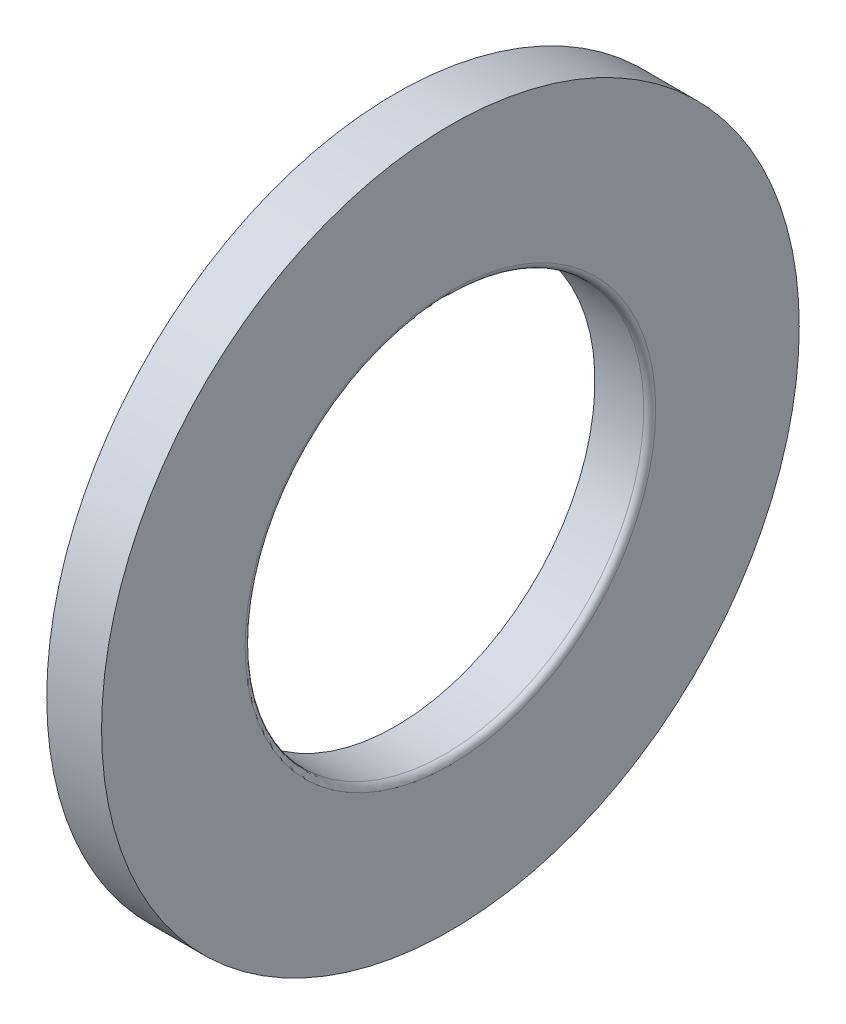
ISO-10303-21;
HEADER;
FILE_DESCRIPTION(('STEP AP214'),'2;1');
FILE_NAME('part.step','',(''),(''),'','','');
FILE_SCHEMA(('AUTOMOTIVE_DESIGN { 1 0 10303 214 1 1 1 1 }'));
ENDSEC;
DATA;
#1=APPLICATION_CONTEXT('core data for automotive mechanical design processes');
#2=APPLICATION_PROTOCOL_DEFINITION('international standard','automotive_design',2000,#1);
#3=PRODUCT_CONTEXT('',#1,'mechanical');
#4=PRODUCT('Part','Part','',(#3));
#5=PRODUCT_RELATED_PRODUCT_CATEGORY('part','',(#4));
#6=PRODUCT_DEFINITION_FORMATION('','',#4);
#7=PRODUCT_DEFINITION_CONTEXT('part definition',#1,'design');
#8=PRODUCT_DEFINITION('design','',#6,#7);
#9=PRODUCT_DEFINITION_SHAPE('','',#8);
#10=(LENGTH_UNIT() NAMED_UNIT(*) SI_UNIT(.MILLI.,.METRE.));
#11=(NAMED_UNIT(*) PLANE_ANGLE_UNIT() SI_UNIT($,.RADIAN.));
#12=(NAMED_UNIT(*) SI_UNIT($,.STERADIAN.) SOLID_ANGLE_UNIT());
#13=UNCERTAINTY_MEASURE_WITH_UNIT(LENGTH_MEASURE(1.E-05),#10,'distance_accuracy_value','');
#14=(GEOMETRIC_REPRESENTATION_CONTEXT(3) GLOBAL_UNCERTAINTY_ASSIGNED_CONTEXT((#13)) GLOBAL_UNIT_ASSIGNED_CONTEXT((#10,
#11,#12)) REPRESENTATION_CONTEXT('',''));
#15=CARTESIAN_POINT('',(0.,0.,0.));
#16=DIRECTION('',(0.,0.,1.));
#17=DIRECTION('',(1.,0.,0.));
#18=AXIS2_PLACEMENT_3D('',#15,#16,#17);
#19=CARTESIAN_POINT('',(1.,17.5,0.));
#20=DIRECTION('',(1.,0.,0.));
#21=DIRECTION('',(0.,0.,-1.));
#22=AXIS2_PLACEMENT_3D('',#19,#20,#21);
#23=PLANE('',#22);
#24=CARTESIAN_POINT('',(1.,0.,0.));
#25=DIRECTION('',(-1.,0.,0.));
#26=DIRECTION('',(0.,0.,1.));
#27=AXIS2_PLACEMENT_3D('',#24,#25,#26);
#28=CIRCLE('',#27,10.);
#29=CARTESIAN_POINT('',(1.,0.,10.));
#30=VERTEX_POINT('',#29);
#31=EDGE_CURVE('E10',#30,#30,#28,.T.);
#32=ORIENTED_EDGE('',*,*,#31,.F.);
#33=EDGE_LOOP('',(#32));
#34=FACE_BOUND('',#33,.T.);
#35=CARTESIAN_POINT('',(1.,0.,0.));
#36=DIRECTION('',(-1.,0.,0.));
#37=DIRECTION('',(0.,0.,1.));
#38=AXIS2_PLACEMENT_3D('',#35,#36,#37);
#39=CIRCLE('',#38,17.5);
#40=CARTESIAN_POINT('',(1.,0.,17.5));
#41=VERTEX_POINT('',#40);
#42=EDGE_CURVE('E48',#41,#41,#39,.T.);
#43=ORIENTED_EDGE('',*,*,#42,.T.);
#44=EDGE_LOOP('',(#43));
#45=FACE_BOUND('',#44,.T.);
#46=ADVANCED_FACE('F29',(#34,#45),#23,.F.);
#47=CARTESIAN_POINT('',(50.,0.,0.));
#48=DIRECTION('',(-1.,0.,0.));
#49=DIRECTION('',(0.,0.,1.));
#50=AXIS2_PLACEMENT_3D('',#47,#48,#49);
#51=CYLINDRICAL_SURFACE('',#50,10.);
#52=CARTESIAN_POINT('',(3.45,0.,0.));
#53=DIRECTION('',(-1.,0.,0.));
#54=DIRECTION('',(0.,0.,1.));
#55=AXIS2_PLACEMENT_3D('',#52,#53,#54);
#56=CIRCLE('',#55,10.);
#57=CARTESIAN_POINT('',(3.45,0.,10.));
#58=VERTEX_POINT('',#57);
#59=EDGE_CURVE('E35',#58,#58,#56,.T.);
#60=ORIENTED_EDGE('',*,*,#59,.F.);
#61=EDGE_LOOP('',(#60));
#62=FACE_BOUND('',#61,.T.);
#63=ORIENTED_EDGE('',*,*,#31,.T.);
#64=EDGE_LOOP('',(#63));
#65=FACE_BOUND('',#64,.T.);
#66=ADVANCED_FACE('F67',(#62,#65),#51,.F.);
#67=CARTESIAN_POINT('',(3.45000000000012,0.,0.));
#68=DIRECTION('',(-1.,0.,0.));
#69=DIRECTION('',(0.,0.,1.));
#70=AXIS2_PLACEMENT_3D('',#67,#68,#69);
#71=TOROIDAL_SURFACE('',#70,10.2999999999999,0.299999999999876);
#72=CARTESIAN_POINT('',(3.75,0.,0.));
#73=DIRECTION('',(-1.,0.,0.));
#74=DIRECTION('',(0.,0.,1.));
#75=AXIS2_PLACEMENT_3D('',#72,#73,#74);
#76=CIRCLE('',#75,10.3);
#77=CARTESIAN_POINT('',(3.75,0.,10.3));
#78=VERTEX_POINT('',#77);
#79=EDGE_CURVE('E39',#78,#78,#76,.T.);
#80=ORIENTED_EDGE('',*,*,#79,.F.);
#81=EDGE_LOOP('',(#80));
#82=FACE_BOUND('',#81,.T.);
#83=ORIENTED_EDGE('',*,*,#59,.T.);
#84=EDGE_LOOP('',(#83));
#85=FACE_BOUND('',#84,.T.);
#86=ADVANCED_FACE('F62',(#82,#85),#71,.T.);
#87=CARTESIAN_POINT('',(3.75,10.3,0.));
#88=DIRECTION('',(-1.,0.,0.));
#89=DIRECTION('',(0.,0.,1.));
#90=AXIS2_PLACEMENT_3D('',#87,#88,#89);
#91=PLANE('',#90);
#92=CARTESIAN_POINT('',(3.75,0.,0.));
#93=DIRECTION('',(-1.,0.,0.));
#94=DIRECTION('',(0.,0.,1.));
#95=AXIS2_PLACEMENT_3D('',#92,#93,#94);
#96=CIRCLE('',#95,17.5);
#97=CARTESIAN_POINT('',(3.75,0.,17.5));
#98=VERTEX_POINT('',#97);
#99=EDGE_CURVE('E43',#98,#98,#96,.T.);
#100=ORIENTED_EDGE('',*,*,#99,.F.);
#101=EDGE_LOOP('',(#100));
#102=FACE_BOUND('',#101,.T.);
#103=ORIENTED_EDGE('',*,*,#79,.T.);
#104=EDGE_LOOP('',(#103));
#105=FACE_BOUND('',#104,.T.);
#106=ADVANCED_FACE('F56',(#102,#105),#91,.F.);
#107=CARTESIAN_POINT('',(50.,0.,0.));
#108=DIRECTION('',(-1.,0.,0.));
#109=DIRECTION('',(0.,0.,1.));
#110=AXIS2_PLACEMENT_3D('',#107,#108,#109);
#111=CYLINDRICAL_SURFACE('',#110,17.5);
#112=ORIENTED_EDGE('',*,*,#42,.F.);
#113=EDGE_LOOP('',(#112));
#114=FACE_BOUND('',#113,.T.);
#115=ORIENTED_EDGE('',*,*,#99,.T.);
#116=EDGE_LOOP('',(#115));
#117=FACE_BOUND('',#116,.T.);
#118=ADVANCED_FACE('F53',(#114,#117),#111,.T.);
#119=CLOSED_SHELL('',(#46,#66,#86,#106,#118));
#120=MANIFOLD_SOLID_BREP('B2',#119);
#121=ADVANCED_BREP_SHAPE_REPRESENTATION('',(#18,#120),#14);
#122=SHAPE_DEFINITION_REPRESENTATION(#9,#121);
ENDSEC;
END-ISO-10303-21;
